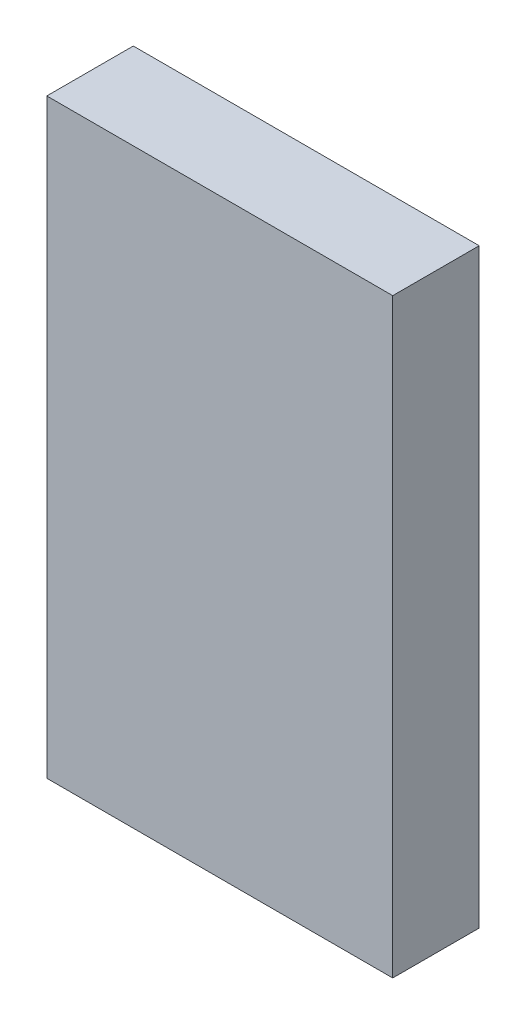
ISO-10303-21;
HEADER;
FILE_DESCRIPTION(('STEP AP214'),'2;1');
FILE_NAME('part.step','',(''),(''),'','','');
FILE_SCHEMA(('AUTOMOTIVE_DESIGN { 1 0 10303 214 1 1 1 1 }'));
ENDSEC;
DATA;
#1=APPLICATION_CONTEXT('core data for automotive mechanical design processes');
#2=APPLICATION_PROTOCOL_DEFINITION('international standard','automotive_design',2000,#1);
#3=PRODUCT_CONTEXT('',#1,'mechanical');
#4=PRODUCT('Part','Part','',(#3));
#5=PRODUCT_RELATED_PRODUCT_CATEGORY('part','',(#4));
#6=PRODUCT_DEFINITION_FORMATION('','',#4);
#7=PRODUCT_DEFINITION_CONTEXT('part definition',#1,'design');
#8=PRODUCT_DEFINITION('design','',#6,#7);
#9=PRODUCT_DEFINITION_SHAPE('','',#8);
#10=(LENGTH_UNIT() NAMED_UNIT(*) SI_UNIT(.MILLI.,.METRE.));
#11=(NAMED_UNIT(*) PLANE_ANGLE_UNIT() SI_UNIT($,.RADIAN.));
#12=(NAMED_UNIT(*) SI_UNIT($,.STERADIAN.) SOLID_ANGLE_UNIT());
#13=UNCERTAINTY_MEASURE_WITH_UNIT(LENGTH_MEASURE(1.E-05),#10,'distance_accuracy_value','');
#14=(GEOMETRIC_REPRESENTATION_CONTEXT(3) GLOBAL_UNCERTAINTY_ASSIGNED_CONTEXT((#13)) GLOBAL_UNIT_ASSIGNED_CONTEXT((#10,
#11,#12)) REPRESENTATION_CONTEXT('',''));
#15=CARTESIAN_POINT('',(0.,0.,0.));
#16=DIRECTION('',(0.,0.,1.));
#17=DIRECTION('',(1.,0.,0.));
#18=AXIS2_PLACEMENT_3D('',#15,#16,#17);
#19=CARTESIAN_POINT('',(0.,0.,30.));
#20=DIRECTION('',(1.,0.,0.));
#21=DIRECTION('',(0.,1.,0.));
#22=AXIS2_PLACEMENT_3D('',#19,#20,#21);
#23=PLANE('',#22);
#24=DIRECTION('',(0.,-1.,0.));
#25=VECTOR('',#24,1.);
#26=CARTESIAN_POINT('',(0.,0.,0.));
#27=LINE('',#26,#25);
#28=CARTESIAN_POINT('',(0.,0.,0.));
#29=VERTEX_POINT('',#28);
#30=CARTESIAN_POINT('',(0.,-205.,0.));
#31=VERTEX_POINT('',#30);
#32=EDGE_CURVE('E95',#29,#31,#27,.T.);
#33=ORIENTED_EDGE('',*,*,#32,.T.);
#34=DIRECTION('',(0.,0.,-1.));
#35=VECTOR('',#34,1.);
#36=CARTESIAN_POINT('',(0.,-205.,30.));
#37=LINE('',#36,#35);
#38=CARTESIAN_POINT('',(0.,-205.,30.));
#39=VERTEX_POINT('',#38);
#40=EDGE_CURVE('E11',#39,#31,#37,.T.);
#41=ORIENTED_EDGE('',*,*,#40,.F.);
#42=DIRECTION('',(0.,-1.,0.));
#43=VECTOR('',#42,1.);
#44=CARTESIAN_POINT('',(0.,0.,30.));
#45=LINE('',#44,#43);
#46=CARTESIAN_POINT('',(0.,0.,30.));
#47=VERTEX_POINT('',#46);
#48=EDGE_CURVE('E83',#47,#39,#45,.T.);
#49=ORIENTED_EDGE('',*,*,#48,.F.);
#50=DIRECTION('',(0.,0.,-1.));
#51=VECTOR('',#50,1.);
#52=CARTESIAN_POINT('',(0.,0.,30.));
#53=LINE('',#52,#51);
#54=EDGE_CURVE('E91',#47,#29,#53,.T.);
#55=ORIENTED_EDGE('',*,*,#54,.T.);
#56=EDGE_LOOP('',(#33,#41,#49,#55));
#57=FACE_BOUND('',#56,.T.);
#58=ADVANCED_FACE('F32',(#57),#23,.F.);
#59=CARTESIAN_POINT('',(0.,-205.,30.));
#60=DIRECTION('',(0.,1.,0.));
#61=DIRECTION('',(0.,0.,1.));
#62=AXIS2_PLACEMENT_3D('',#59,#60,#61);
#63=PLANE('',#62);
#64=DIRECTION('',(1.,0.,0.));
#65=VECTOR('',#64,1.);
#66=CARTESIAN_POINT('',(0.,-205.,0.));
#67=LINE('',#66,#65);
#68=CARTESIAN_POINT('',(120.,-205.,0.));
#69=VERTEX_POINT('',#68);
#70=EDGE_CURVE('E87',#31,#69,#67,.T.);
#71=ORIENTED_EDGE('',*,*,#70,.T.);
#72=DIRECTION('',(0.,0.,-1.));
#73=VECTOR('',#72,1.);
#74=CARTESIAN_POINT('',(120.,-205.,30.));
#75=LINE('',#74,#73);
#76=CARTESIAN_POINT('',(120.,-205.,30.));
#77=VERTEX_POINT('',#76);
#78=EDGE_CURVE('E40',#77,#69,#75,.T.);
#79=ORIENTED_EDGE('',*,*,#78,.F.);
#80=DIRECTION('',(1.,0.,0.));
#81=VECTOR('',#80,1.);
#82=CARTESIAN_POINT('',(0.,-205.,30.));
#83=LINE('',#82,#81);
#84=EDGE_CURVE('E78',#39,#77,#83,.T.);
#85=ORIENTED_EDGE('',*,*,#84,.F.);
#86=ORIENTED_EDGE('',*,*,#40,.T.);
#87=EDGE_LOOP('',(#71,#79,#85,#86));
#88=FACE_BOUND('',#87,.T.);
#89=ADVANCED_FACE('F86',(#88),#63,.F.);
#90=CARTESIAN_POINT('',(120.,0.,30.));
#91=DIRECTION('',(-1.,0.,0.));
#92=DIRECTION('',(0.,-1.,0.));
#93=AXIS2_PLACEMENT_3D('',#90,#91,#92);
#94=PLANE('',#93);
#95=DIRECTION('',(0.,1.,0.));
#96=VECTOR('',#95,1.);
#97=CARTESIAN_POINT('',(120.,0.,0.));
#98=LINE('',#97,#96);
#99=CARTESIAN_POINT('',(120.,0.,0.));
#100=VERTEX_POINT('',#99);
#101=EDGE_CURVE('E65',#69,#100,#98,.T.);
#102=ORIENTED_EDGE('',*,*,#101,.T.);
#103=DIRECTION('',(0.,0.,-1.));
#104=VECTOR('',#103,1.);
#105=CARTESIAN_POINT('',(120.,0.,30.));
#106=LINE('',#105,#104);
#107=CARTESIAN_POINT('',(120.,0.,30.));
#108=VERTEX_POINT('',#107);
#109=EDGE_CURVE('E88',#108,#100,#106,.T.);
#110=ORIENTED_EDGE('',*,*,#109,.F.);
#111=DIRECTION('',(0.,1.,0.));
#112=VECTOR('',#111,1.);
#113=CARTESIAN_POINT('',(120.,0.,30.));
#114=LINE('',#113,#112);
#115=EDGE_CURVE('E81',#77,#108,#114,.T.);
#116=ORIENTED_EDGE('',*,*,#115,.F.);
#117=ORIENTED_EDGE('',*,*,#78,.T.);
#118=EDGE_LOOP('',(#102,#110,#116,#117));
#119=FACE_BOUND('',#118,.T.);
#120=ADVANCED_FACE('F89',(#119),#94,.F.);
#121=CARTESIAN_POINT('',(0.,0.,30.));
#122=DIRECTION('',(0.,-1.,0.));
#123=DIRECTION('',(0.,0.,-1.));
#124=AXIS2_PLACEMENT_3D('',#121,#122,#123);
#125=PLANE('',#124);
#126=DIRECTION('',(-1.,0.,0.));
#127=VECTOR('',#126,1.);
#128=CARTESIAN_POINT('',(0.,0.,0.));
#129=LINE('',#128,#127);
#130=EDGE_CURVE('E71',#100,#29,#129,.T.);
#131=ORIENTED_EDGE('',*,*,#130,.T.);
#132=ORIENTED_EDGE('',*,*,#54,.F.);
#133=DIRECTION('',(-1.,0.,0.));
#134=VECTOR('',#133,1.);
#135=CARTESIAN_POINT('',(0.,0.,30.));
#136=LINE('',#135,#134);
#137=EDGE_CURVE('E48',#108,#47,#136,.T.);
#138=ORIENTED_EDGE('',*,*,#137,.F.);
#139=ORIENTED_EDGE('',*,*,#109,.T.);
#140=EDGE_LOOP('',(#131,#132,#138,#139));
#141=FACE_BOUND('',#140,.T.);
#142=ADVANCED_FACE('F102',(#141),#125,.F.);
#143=CARTESIAN_POINT('',(0.,0.,30.));
#144=DIRECTION('',(0.,0.,1.));
#145=DIRECTION('',(1.,0.,0.));
#146=AXIS2_PLACEMENT_3D('',#143,#144,#145);
#147=PLANE('',#146);
#148=ORIENTED_EDGE('',*,*,#48,.T.);
#149=ORIENTED_EDGE('',*,*,#84,.T.);
#150=ORIENTED_EDGE('',*,*,#115,.T.);
#151=ORIENTED_EDGE('',*,*,#137,.T.);
#152=EDGE_LOOP('',(#148,#149,#150,#151));
#153=FACE_BOUND('',#152,.T.);
#154=ADVANCED_FACE('F79',(#153),#147,.T.);
#155=CARTESIAN_POINT('',(0.,0.,0.));
#156=DIRECTION('',(0.,0.,1.));
#157=DIRECTION('',(1.,0.,0.));
#158=AXIS2_PLACEMENT_3D('',#155,#156,#157);
#159=PLANE('',#158);
#160=ORIENTED_EDGE('',*,*,#32,.F.);
#161=ORIENTED_EDGE('',*,*,#130,.F.);
#162=ORIENTED_EDGE('',*,*,#101,.F.);
#163=ORIENTED_EDGE('',*,*,#70,.F.);
#164=EDGE_LOOP('',(#160,#161,#162,#163));
#165=FACE_BOUND('',#164,.T.);
#166=ADVANCED_FACE('F105',(#165),#159,.F.);
#167=CLOSED_SHELL('',(#58,#89,#120,#142,#154,#166));
#168=MANIFOLD_SOLID_BREP('B2',#167);
#169=ADVANCED_BREP_SHAPE_REPRESENTATION('',(#18,#168),#14);
#170=SHAPE_DEFINITION_REPRESENTATION(#9,#169);
ENDSEC;
END-ISO-10303-21;
